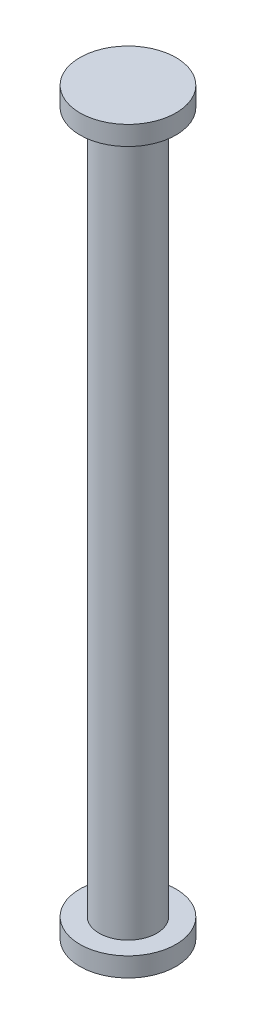
ISO-10303-21;
HEADER;
FILE_DESCRIPTION(('STEP AP214'),'2;1');
FILE_NAME('part.step','',(''),(''),'','','');
FILE_SCHEMA(('AUTOMOTIVE_DESIGN { 1 0 10303 214 1 1 1 1 }'));
ENDSEC;
DATA;
#1=APPLICATION_CONTEXT('core data for automotive mechanical design processes');
#2=APPLICATION_PROTOCOL_DEFINITION('international standard','automotive_design',2000,#1);
#3=PRODUCT_CONTEXT('',#1,'mechanical');
#4=PRODUCT('Part','Part','',(#3));
#5=PRODUCT_RELATED_PRODUCT_CATEGORY('part','',(#4));
#6=PRODUCT_DEFINITION_FORMATION('','',#4);
#7=PRODUCT_DEFINITION_CONTEXT('part definition',#1,'design');
#8=PRODUCT_DEFINITION('design','',#6,#7);
#9=PRODUCT_DEFINITION_SHAPE('','',#8);
#10=(LENGTH_UNIT() NAMED_UNIT(*) SI_UNIT(.MILLI.,.METRE.));
#11=(NAMED_UNIT(*) PLANE_ANGLE_UNIT() SI_UNIT($,.RADIAN.));
#12=(NAMED_UNIT(*) SI_UNIT($,.STERADIAN.) SOLID_ANGLE_UNIT());
#13=UNCERTAINTY_MEASURE_WITH_UNIT(LENGTH_MEASURE(1.E-05),#10,'distance_accuracy_value','');
#14=(GEOMETRIC_REPRESENTATION_CONTEXT(3) GLOBAL_UNCERTAINTY_ASSIGNED_CONTEXT((#13)) GLOBAL_UNIT_ASSIGNED_CONTEXT((#10,
#11,#12)) REPRESENTATION_CONTEXT('',''));
#15=CARTESIAN_POINT('',(0.,0.,0.));
#16=DIRECTION('',(0.,0.,1.));
#17=DIRECTION('',(1.,0.,0.));
#18=AXIS2_PLACEMENT_3D('',#15,#16,#17);
#19=CARTESIAN_POINT('',(0.,-13.6,0.));
#20=DIRECTION('',(0.,-1.,0.));
#21=DIRECTION('',(0.,0.,-1.));
#22=AXIS2_PLACEMENT_3D('',#19,#20,#21);
#23=CYLINDRICAL_SURFACE('',#22,4.5);
#24=CARTESIAN_POINT('',(0.,-13.6,0.));
#25=DIRECTION('',(0.,1.,0.));
#26=DIRECTION('',(0.,0.,1.));
#27=AXIS2_PLACEMENT_3D('',#24,#25,#26);
#28=CIRCLE('',#27,4.5);
#29=CARTESIAN_POINT('',(0.,-13.6,4.5));
#30=VERTEX_POINT('',#29);
#31=EDGE_CURVE('E44',#30,#30,#28,.T.);
#32=ORIENTED_EDGE('',*,*,#31,.F.);
#33=EDGE_LOOP('',(#32));
#34=FACE_BOUND('',#33,.T.);
#35=CARTESIAN_POINT('',(0.,-15.4,0.));
#36=DIRECTION('',(0.,1.,0.));
#37=DIRECTION('',(0.,0.,1.));
#38=AXIS2_PLACEMENT_3D('',#35,#36,#37);
#39=CIRCLE('',#38,4.5);
#40=CARTESIAN_POINT('',(0.,-15.4,4.5));
#41=VERTEX_POINT('',#40);
#42=EDGE_CURVE('E40',#41,#41,#39,.T.);
#43=ORIENTED_EDGE('',*,*,#42,.T.);
#44=EDGE_LOOP('',(#43));
#45=FACE_BOUND('',#44,.T.);
#46=ADVANCED_FACE('F37',(#34,#45),#23,.T.);
#47=CARTESIAN_POINT('',(0.,-13.6,0.));
#48=DIRECTION('',(0.,1.,0.));
#49=DIRECTION('',(0.,0.,1.));
#50=AXIS2_PLACEMENT_3D('',#47,#48,#49);
#51=PLANE('',#50);
#52=CARTESIAN_POINT('',(0.,-13.6,0.));
#53=DIRECTION('',(0.,1.,0.));
#54=DIRECTION('',(0.,0.,1.));
#55=AXIS2_PLACEMENT_3D('',#52,#53,#54);
#56=CIRCLE('',#55,2.7);
#57=CARTESIAN_POINT('',(0.,-13.6,2.7));
#58=VERTEX_POINT('',#57);
#59=EDGE_CURVE('E10',#58,#58,#56,.T.);
#60=ORIENTED_EDGE('',*,*,#59,.F.);
#61=EDGE_LOOP('',(#60));
#62=FACE_BOUND('',#61,.T.);
#63=ORIENTED_EDGE('',*,*,#31,.T.);
#64=EDGE_LOOP('',(#63));
#65=FACE_BOUND('',#64,.T.);
#66=ADVANCED_FACE('F78',(#62,#65),#51,.T.);
#67=CARTESIAN_POINT('',(0.,-15.4,0.));
#68=DIRECTION('',(0.,1.,0.));
#69=DIRECTION('',(0.,0.,1.));
#70=AXIS2_PLACEMENT_3D('',#67,#68,#69);
#71=PLANE('',#70);
#72=ORIENTED_EDGE('',*,*,#42,.F.);
#73=EDGE_LOOP('',(#72));
#74=FACE_BOUND('',#73,.T.);
#75=ADVANCED_FACE('F83',(#74),#71,.F.);
#76=CARTESIAN_POINT('',(0.,52.1,0.));
#77=DIRECTION('',(0.,-1.,0.));
#78=DIRECTION('',(0.,0.,-1.));
#79=AXIS2_PLACEMENT_3D('',#76,#77,#78);
#80=CYLINDRICAL_SURFACE('',#79,2.7);
#81=CARTESIAN_POINT('',(0.,52.1,0.));
#82=DIRECTION('',(0.,1.,0.));
#83=DIRECTION('',(0.,0.,1.));
#84=AXIS2_PLACEMENT_3D('',#81,#82,#83);
#85=CIRCLE('',#84,2.7);
#86=CARTESIAN_POINT('',(0.,52.1,2.7));
#87=VERTEX_POINT('',#86);
#88=EDGE_CURVE('E50',#87,#87,#85,.T.);
#89=ORIENTED_EDGE('',*,*,#88,.F.);
#90=EDGE_LOOP('',(#89));
#91=FACE_BOUND('',#90,.T.);
#92=ORIENTED_EDGE('',*,*,#59,.T.);
#93=EDGE_LOOP('',(#92));
#94=FACE_BOUND('',#93,.T.);
#95=ADVANCED_FACE('F65',(#91,#94),#80,.T.);
#96=CARTESIAN_POINT('',(0.,53.9,0.));
#97=DIRECTION('',(0.,-1.,0.));
#98=DIRECTION('',(0.,0.,-1.));
#99=AXIS2_PLACEMENT_3D('',#96,#97,#98);
#100=CYLINDRICAL_SURFACE('',#99,4.5);
#101=CARTESIAN_POINT('',(0.,53.9,0.));
#102=DIRECTION('',(0.,1.,0.));
#103=DIRECTION('',(0.,0.,1.));
#104=AXIS2_PLACEMENT_3D('',#101,#102,#103);
#105=CIRCLE('',#104,4.5);
#106=CARTESIAN_POINT('',(0.,53.9,4.5));
#107=VERTEX_POINT('',#106);
#108=EDGE_CURVE('E53',#107,#107,#105,.T.);
#109=ORIENTED_EDGE('',*,*,#108,.F.);
#110=EDGE_LOOP('',(#109));
#111=FACE_BOUND('',#110,.T.);
#112=CARTESIAN_POINT('',(0.,52.1,0.));
#113=DIRECTION('',(0.,1.,0.));
#114=DIRECTION('',(0.,0.,1.));
#115=AXIS2_PLACEMENT_3D('',#112,#113,#114);
#116=CIRCLE('',#115,4.5);
#117=CARTESIAN_POINT('',(0.,52.1,4.5));
#118=VERTEX_POINT('',#117);
#119=EDGE_CURVE('E54',#118,#118,#116,.T.);
#120=ORIENTED_EDGE('',*,*,#119,.T.);
#121=EDGE_LOOP('',(#120));
#122=FACE_BOUND('',#121,.T.);
#123=ADVANCED_FACE('F62',(#111,#122),#100,.T.);
#124=CARTESIAN_POINT('',(0.,53.9,0.));
#125=DIRECTION('',(0.,1.,0.));
#126=DIRECTION('',(0.,0.,1.));
#127=AXIS2_PLACEMENT_3D('',#124,#125,#126);
#128=PLANE('',#127);
#129=ORIENTED_EDGE('',*,*,#108,.T.);
#130=EDGE_LOOP('',(#129));
#131=FACE_BOUND('',#130,.T.);
#132=ADVANCED_FACE('F60',(#131),#128,.T.);
#133=CARTESIAN_POINT('',(0.,52.1,0.));
#134=DIRECTION('',(0.,1.,0.));
#135=DIRECTION('',(0.,0.,1.));
#136=AXIS2_PLACEMENT_3D('',#133,#134,#135);
#137=PLANE('',#136);
#138=ORIENTED_EDGE('',*,*,#88,.T.);
#139=EDGE_LOOP('',(#138));
#140=FACE_BOUND('',#139,.T.);
#141=ORIENTED_EDGE('',*,*,#119,.F.);
#142=EDGE_LOOP('',(#141));
#143=FACE_BOUND('',#142,.T.);
#144=ADVANCED_FACE('F69',(#140,#143),#137,.F.);
#145=CLOSED_SHELL('',(#46,#66,#75,#95,#123,#132,#144));
#146=MANIFOLD_SOLID_BREP('B2',#145);
#147=ADVANCED_BREP_SHAPE_REPRESENTATION('',(#18,#146),#14);
#148=SHAPE_DEFINITION_REPRESENTATION(#9,#147);
ENDSEC;
END-ISO-10303-21;
